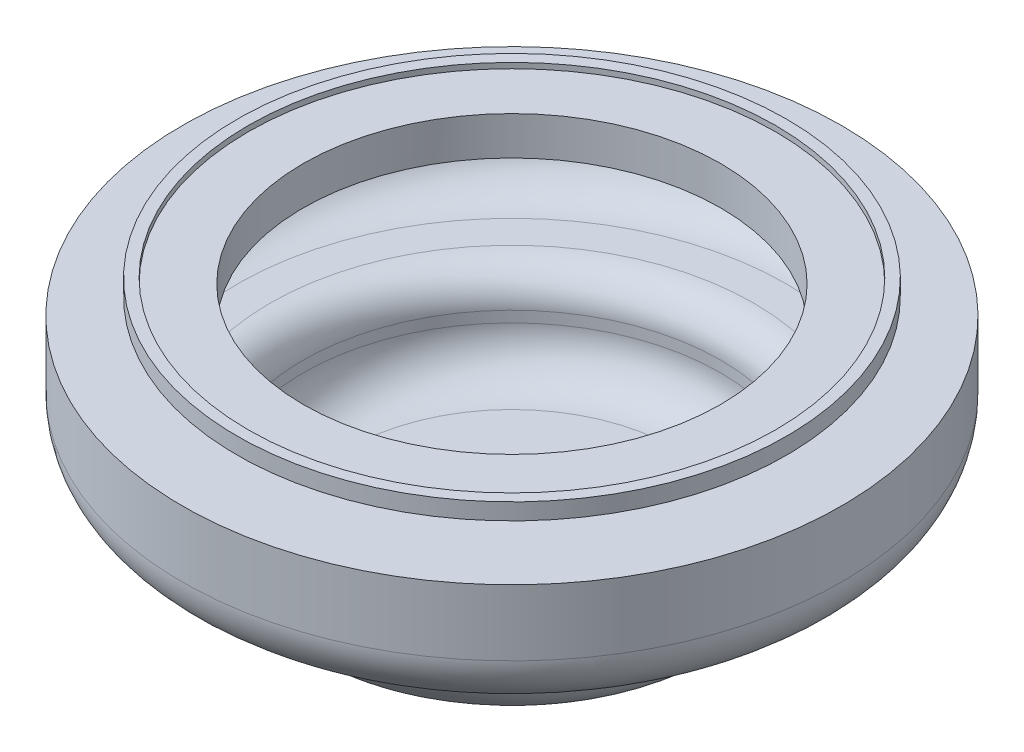
ISO-10303-21;
HEADER;
FILE_DESCRIPTION(('STEP AP214'),'2;1');
FILE_NAME('part.step','',(''),(''),'','','');
FILE_SCHEMA(('AUTOMOTIVE_DESIGN { 1 0 10303 214 1 1 1 1 }'));
ENDSEC;
DATA;
#1=APPLICATION_CONTEXT('core data for automotive mechanical design processes');
#2=APPLICATION_PROTOCOL_DEFINITION('international standard','automotive_design',2000,#1);
#3=PRODUCT_CONTEXT('',#1,'mechanical');
#4=PRODUCT('Part','Part','',(#3));
#5=PRODUCT_RELATED_PRODUCT_CATEGORY('part','',(#4));
#6=PRODUCT_DEFINITION_FORMATION('','',#4);
#7=PRODUCT_DEFINITION_CONTEXT('part definition',#1,'design');
#8=PRODUCT_DEFINITION('design','',#6,#7);
#9=PRODUCT_DEFINITION_SHAPE('','',#8);
#10=(LENGTH_UNIT() NAMED_UNIT(*) SI_UNIT(.MILLI.,.METRE.));
#11=(NAMED_UNIT(*) PLANE_ANGLE_UNIT() SI_UNIT($,.RADIAN.));
#12=(NAMED_UNIT(*) SI_UNIT($,.STERADIAN.) SOLID_ANGLE_UNIT());
#13=UNCERTAINTY_MEASURE_WITH_UNIT(LENGTH_MEASURE(1.E-05),#10,'distance_accuracy_value','');
#14=(GEOMETRIC_REPRESENTATION_CONTEXT(3) GLOBAL_UNCERTAINTY_ASSIGNED_CONTEXT((#13)) GLOBAL_UNIT_ASSIGNED_CONTEXT((#10,
#11,#12)) REPRESENTATION_CONTEXT('',''));
#15=CARTESIAN_POINT('',(0.,0.,0.));
#16=DIRECTION('',(0.,0.,1.));
#17=DIRECTION('',(1.,0.,0.));
#18=AXIS2_PLACEMENT_3D('',#15,#16,#17);
#19=CARTESIAN_POINT('',(0.,0.,0.));
#20=DIRECTION('',(0.,-1.,0.));
#21=DIRECTION('',(0.,0.,-1.));
#22=AXIS2_PLACEMENT_3D('',#19,#20,#21);
#23=PLANE('',#22);
#24=CARTESIAN_POINT('',(0.,0.,0.));
#25=DIRECTION('',(0.,-1.,0.));
#26=DIRECTION('',(0.,0.,-1.));
#27=AXIS2_PLACEMENT_3D('',#24,#25,#26);
#28=CIRCLE('',#27,24.);
#29=CARTESIAN_POINT('',(0.,0.,-24.));
#30=VERTEX_POINT('',#29);
#31=EDGE_CURVE('E75',#30,#30,#28,.T.);
#32=ORIENTED_EDGE('',*,*,#31,.T.);
#33=EDGE_LOOP('',(#32));
#34=FACE_BOUND('',#33,.T.);
#35=CARTESIAN_POINT('',(0.,0.,0.));
#36=DIRECTION('',(0.,-1.,0.));
#37=DIRECTION('',(0.,0.,-1.));
#38=AXIS2_PLACEMENT_3D('',#35,#36,#37);
#39=CIRCLE('',#38,25.);
#40=CARTESIAN_POINT('',(0.,0.,-25.));
#41=VERTEX_POINT('',#40);
#42=EDGE_CURVE('E10',#41,#41,#39,.T.);
#43=ORIENTED_EDGE('',*,*,#42,.F.);
#44=EDGE_LOOP('',(#43));
#45=FACE_BOUND('',#44,.T.);
#46=ADVANCED_FACE('F35',(#34,#45),#23,.F.);
#47=CARTESIAN_POINT('',(0.,-22.,0.));
#48=DIRECTION('',(0.,-1.,0.));
#49=DIRECTION('',(0.,0.,-1.));
#50=AXIS2_PLACEMENT_3D('',#47,#48,#49);
#51=CYLINDRICAL_SURFACE('',#50,25.);
#52=CARTESIAN_POINT('',(0.,-1.5,0.));
#53=DIRECTION('',(0.,-1.,0.));
#54=DIRECTION('',(0.,0.,-1.));
#55=AXIS2_PLACEMENT_3D('',#52,#53,#54);
#56=CIRCLE('',#55,25.);
#57=CARTESIAN_POINT('',(0.,-1.5,-25.));
#58=VERTEX_POINT('',#57);
#59=EDGE_CURVE('E41',#58,#58,#56,.T.);
#60=ORIENTED_EDGE('',*,*,#59,.F.);
#61=EDGE_LOOP('',(#60));
#62=FACE_BOUND('',#61,.T.);
#63=ORIENTED_EDGE('',*,*,#42,.T.);
#64=EDGE_LOOP('',(#63));
#65=FACE_BOUND('',#64,.T.);
#66=ADVANCED_FACE('F127',(#62,#65),#51,.T.);
#67=CARTESIAN_POINT('',(-25.,-1.5,0.));
#68=DIRECTION('',(0.,1.,0.));
#69=DIRECTION('',(0.,0.,1.));
#70=AXIS2_PLACEMENT_3D('',#67,#68,#69);
#71=PLANE('',#70);
#72=CARTESIAN_POINT('',(0.,-1.5,0.));
#73=DIRECTION('',(0.,-1.,0.));
#74=DIRECTION('',(0.,0.,-1.));
#75=AXIS2_PLACEMENT_3D('',#72,#73,#74);
#76=CIRCLE('',#75,20.);
#77=CARTESIAN_POINT('',(0.,-1.5,-20.));
#78=VERTEX_POINT('',#77);
#79=EDGE_CURVE('E45',#78,#78,#76,.T.);
#80=ORIENTED_EDGE('',*,*,#79,.F.);
#81=EDGE_LOOP('',(#80));
#82=FACE_BOUND('',#81,.T.);
#83=ORIENTED_EDGE('',*,*,#59,.T.);
#84=EDGE_LOOP('',(#83));
#85=FACE_BOUND('',#84,.T.);
#86=ADVANCED_FACE('F132',(#82,#85),#71,.F.);
#87=CARTESIAN_POINT('',(0.,-22.,0.));
#88=DIRECTION('',(0.,-1.,0.));
#89=DIRECTION('',(0.,0.,-1.));
#90=AXIS2_PLACEMENT_3D('',#87,#88,#89);
#91=CYLINDRICAL_SURFACE('',#90,20.);
#92=CARTESIAN_POINT('',(0.,-3.,0.));
#93=DIRECTION('',(0.,-1.,0.));
#94=DIRECTION('',(0.,0.,-1.));
#95=AXIS2_PLACEMENT_3D('',#92,#93,#94);
#96=CIRCLE('',#95,20.);
#97=CARTESIAN_POINT('',(0.,-3.,-20.));
#98=VERTEX_POINT('',#97);
#99=EDGE_CURVE('E49',#98,#98,#96,.T.);
#100=ORIENTED_EDGE('',*,*,#99,.F.);
#101=EDGE_LOOP('',(#100));
#102=FACE_BOUND('',#101,.T.);
#103=ORIENTED_EDGE('',*,*,#79,.T.);
#104=EDGE_LOOP('',(#103));
#105=FACE_BOUND('',#104,.T.);
#106=ADVANCED_FACE('F139',(#102,#105),#91,.T.);
#107=CARTESIAN_POINT('',(-20.,-3.,0.));
#108=DIRECTION('',(0.,-1.,0.));
#109=DIRECTION('',(0.,0.,-1.));
#110=AXIS2_PLACEMENT_3D('',#107,#108,#109);
#111=PLANE('',#110);
#112=CARTESIAN_POINT('',(0.,-3.00000000000001,0.));
#113=DIRECTION('',(0.,-1.,0.));
#114=DIRECTION('',(0.,0.,-1.));
#115=AXIS2_PLACEMENT_3D('',#112,#113,#114);
#116=CIRCLE('',#115,30.);
#117=CARTESIAN_POINT('',(0.,-3.00000000000001,-30.));
#118=VERTEX_POINT('',#117);
#119=EDGE_CURVE('E54',#118,#118,#116,.T.);
#120=ORIENTED_EDGE('',*,*,#119,.F.);
#121=EDGE_LOOP('',(#120));
#122=FACE_BOUND('',#121,.T.);
#123=ORIENTED_EDGE('',*,*,#99,.T.);
#124=EDGE_LOOP('',(#123));
#125=FACE_BOUND('',#124,.T.);
#126=ADVANCED_FACE('F145',(#122,#125),#111,.F.);
#127=CARTESIAN_POINT('',(0.,-22.,0.));
#128=DIRECTION('',(0.,-1.,0.));
#129=DIRECTION('',(0.,0.,-1.));
#130=AXIS2_PLACEMENT_3D('',#127,#128,#129);
#131=CYLINDRICAL_SURFACE('',#130,30.);
#132=CARTESIAN_POINT('',(0.,-9.00000000000001,0.));
#133=DIRECTION('',(0.,-1.,0.));
#134=DIRECTION('',(0.,0.,-1.));
#135=AXIS2_PLACEMENT_3D('',#132,#133,#134);
#136=CIRCLE('',#135,30.);
#137=CARTESIAN_POINT('',(0.,-9.00000000000001,-30.));
#138=VERTEX_POINT('',#137);
#139=EDGE_CURVE('E57',#138,#138,#136,.T.);
#140=ORIENTED_EDGE('',*,*,#139,.F.);
#141=EDGE_LOOP('',(#140));
#142=FACE_BOUND('',#141,.T.);
#143=ORIENTED_EDGE('',*,*,#119,.T.);
#144=EDGE_LOOP('',(#143));
#145=FACE_BOUND('',#144,.T.);
#146=ADVANCED_FACE('F149',(#142,#145),#131,.T.);
#147=CARTESIAN_POINT('',(0.,-9.00000000000001,0.));
#148=DIRECTION('',(0.,-1.,0.));
#149=DIRECTION('',(0.,0.,-1.));
#150=AXIS2_PLACEMENT_3D('',#147,#148,#149);
#151=TOROIDAL_SURFACE('',#150,25.,5.);
#152=CARTESIAN_POINT('',(0.,-14.,0.));
#153=DIRECTION('',(0.,-1.,0.));
#154=DIRECTION('',(0.,0.,-1.));
#155=AXIS2_PLACEMENT_3D('',#152,#153,#154);
#156=CIRCLE('',#155,25.);
#157=CARTESIAN_POINT('',(0.,-14.,-25.));
#158=VERTEX_POINT('',#157);
#159=EDGE_CURVE('E60',#158,#158,#156,.T.);
#160=ORIENTED_EDGE('',*,*,#159,.F.);
#161=EDGE_LOOP('',(#160));
#162=FACE_BOUND('',#161,.T.);
#163=ORIENTED_EDGE('',*,*,#139,.T.);
#164=EDGE_LOOP('',(#163));
#165=FACE_BOUND('',#164,.T.);
#166=ADVANCED_FACE('F153',(#162,#165),#151,.T.);
#167=CARTESIAN_POINT('',(-25.,-14.,0.));
#168=DIRECTION('',(0.,1.,0.));
#169=DIRECTION('',(0.,0.,1.));
#170=AXIS2_PLACEMENT_3D('',#167,#168,#169);
#171=PLANE('',#170);
#172=CARTESIAN_POINT('',(0.,-14.,0.));
#173=DIRECTION('',(0.,-1.,0.));
#174=DIRECTION('',(0.,0.,-1.));
#175=AXIS2_PLACEMENT_3D('',#172,#173,#174);
#176=CIRCLE('',#175,22.);
#177=CARTESIAN_POINT('',(0.,-14.,-22.));
#178=VERTEX_POINT('',#177);
#179=EDGE_CURVE('E63',#178,#178,#176,.T.);
#180=ORIENTED_EDGE('',*,*,#179,.F.);
#181=EDGE_LOOP('',(#180));
#182=FACE_BOUND('',#181,.T.);
#183=ORIENTED_EDGE('',*,*,#159,.T.);
#184=EDGE_LOOP('',(#183));
#185=FACE_BOUND('',#184,.T.);
#186=ADVANCED_FACE('F157',(#182,#185),#171,.F.);
#187=CARTESIAN_POINT('',(0.,-16.,0.));
#188=DIRECTION('',(0.,-1.,0.));
#189=DIRECTION('',(0.,0.,-1.));
#190=AXIS2_PLACEMENT_3D('',#187,#188,#189);
#191=TOROIDAL_SURFACE('',#190,22.,2.);
#192=CARTESIAN_POINT('',(0.,-16.,0.));
#193=DIRECTION('',(0.,-1.,0.));
#194=DIRECTION('',(0.,0.,-1.));
#195=AXIS2_PLACEMENT_3D('',#192,#193,#194);
#196=CIRCLE('',#195,20.);
#197=CARTESIAN_POINT('',(0.,-16.,-20.));
#198=VERTEX_POINT('',#197);
#199=EDGE_CURVE('E66',#198,#198,#196,.T.);
#200=ORIENTED_EDGE('',*,*,#199,.F.);
#201=EDGE_LOOP('',(#200));
#202=FACE_BOUND('',#201,.T.);
#203=ORIENTED_EDGE('',*,*,#179,.T.);
#204=EDGE_LOOP('',(#203));
#205=FACE_BOUND('',#204,.T.);
#206=ADVANCED_FACE('F161',(#202,#205),#191,.F.);
#207=CARTESIAN_POINT('',(0.,-22.,0.));
#208=DIRECTION('',(0.,-1.,0.));
#209=DIRECTION('',(0.,0.,-1.));
#210=AXIS2_PLACEMENT_3D('',#207,#208,#209);
#211=CYLINDRICAL_SURFACE('',#210,20.);
#212=CARTESIAN_POINT('',(0.,-17.,0.));
#213=DIRECTION('',(0.,-1.,0.));
#214=DIRECTION('',(0.,0.,-1.));
#215=AXIS2_PLACEMENT_3D('',#212,#213,#214);
#216=CIRCLE('',#215,20.);
#217=CARTESIAN_POINT('',(0.,-17.,-20.));
#218=VERTEX_POINT('',#217);
#219=EDGE_CURVE('E69',#218,#218,#216,.T.);
#220=ORIENTED_EDGE('',*,*,#219,.F.);
#221=EDGE_LOOP('',(#220));
#222=FACE_BOUND('',#221,.T.);
#223=ORIENTED_EDGE('',*,*,#199,.T.);
#224=EDGE_LOOP('',(#223));
#225=FACE_BOUND('',#224,.T.);
#226=ADVANCED_FACE('F165',(#222,#225),#211,.T.);
#227=CARTESIAN_POINT('',(0.,-17.,0.));
#228=DIRECTION('',(0.,-1.,0.));
#229=DIRECTION('',(0.,0.,-1.));
#230=AXIS2_PLACEMENT_3D('',#227,#228,#229);
#231=TOROIDAL_SURFACE('',#230,15.,5.);
#232=CARTESIAN_POINT('',(0.,-22.,0.));
#233=DIRECTION('',(0.,-1.,0.));
#234=DIRECTION('',(0.,0.,-1.));
#235=AXIS2_PLACEMENT_3D('',#232,#233,#234);
#236=CIRCLE('',#235,15.);
#237=CARTESIAN_POINT('',(0.,-22.,-15.));
#238=VERTEX_POINT('',#237);
#239=EDGE_CURVE('E72',#238,#238,#236,.T.);
#240=ORIENTED_EDGE('',*,*,#239,.F.);
#241=EDGE_LOOP('',(#240));
#242=FACE_BOUND('',#241,.T.);
#243=ORIENTED_EDGE('',*,*,#219,.T.);
#244=EDGE_LOOP('',(#243));
#245=FACE_BOUND('',#244,.T.);
#246=ADVANCED_FACE('F169',(#242,#245),#231,.T.);
#247=CARTESIAN_POINT('',(-15.,-22.,0.));
#248=DIRECTION('',(0.,1.,0.));
#249=DIRECTION('',(0.,0.,1.));
#250=AXIS2_PLACEMENT_3D('',#247,#248,#249);
#251=PLANE('',#250);
#252=ORIENTED_EDGE('',*,*,#239,.T.);
#253=EDGE_LOOP('',(#252));
#254=FACE_BOUND('',#253,.T.);
#255=ADVANCED_FACE('F124',(#254),#251,.F.);
#256=CARTESIAN_POINT('',(0.,-22.,0.));
#257=DIRECTION('',(0.,-1.,0.));
#258=DIRECTION('',(0.,0.,-1.));
#259=AXIS2_PLACEMENT_3D('',#256,#257,#258);
#260=CYLINDRICAL_SURFACE('',#259,24.);
#261=CARTESIAN_POINT('',(0.,-0.500000000000004,0.));
#262=DIRECTION('',(0.,1.,0.));
#263=DIRECTION('',(0.,0.,1.));
#264=AXIS2_PLACEMENT_3D('',#261,#262,#263);
#265=CIRCLE('',#264,24.);
#266=CARTESIAN_POINT('',(0.,-0.500000000000004,24.));
#267=VERTEX_POINT('',#266);
#268=EDGE_CURVE('E78',#267,#267,#265,.F.);
#269=ORIENTED_EDGE('',*,*,#268,.T.);
#270=EDGE_LOOP('',(#269));
#271=FACE_BOUND('',#270,.T.);
#272=ORIENTED_EDGE('',*,*,#31,.F.);
#273=EDGE_LOOP('',(#272));
#274=FACE_BOUND('',#273,.T.);
#275=ADVANCED_FACE('F109',(#271,#274),#260,.F.);
#276=CARTESIAN_POINT('',(-25.,-0.500000000000003,0.));
#277=DIRECTION('',(0.,1.,0.));
#278=DIRECTION('',(0.,0.,1.));
#279=AXIS2_PLACEMENT_3D('',#276,#277,#278);
#280=PLANE('',#279);
#281=CARTESIAN_POINT('',(0.,-0.500000000000004,0.));
#282=DIRECTION('',(0.,1.,0.));
#283=DIRECTION('',(0.,0.,1.));
#284=AXIS2_PLACEMENT_3D('',#281,#282,#283);
#285=CIRCLE('',#284,19.);
#286=CARTESIAN_POINT('',(0.,-0.500000000000004,19.));
#287=VERTEX_POINT('',#286);
#288=EDGE_CURVE('E103',#287,#287,#285,.F.);
#289=ORIENTED_EDGE('',*,*,#288,.T.);
#290=EDGE_LOOP('',(#289));
#291=FACE_BOUND('',#290,.T.);
#292=ORIENTED_EDGE('',*,*,#268,.F.);
#293=EDGE_LOOP('',(#292));
#294=FACE_BOUND('',#293,.T.);
#295=ADVANCED_FACE('F112',(#291,#294),#280,.T.);
#296=CARTESIAN_POINT('',(0.,-22.,0.));
#297=DIRECTION('',(0.,-1.,0.));
#298=DIRECTION('',(0.,0.,-1.));
#299=AXIS2_PLACEMENT_3D('',#296,#297,#298);
#300=CYLINDRICAL_SURFACE('',#299,19.);
#301=CARTESIAN_POINT('',(0.,-4.,0.));
#302=DIRECTION('',(0.,-1.,0.));
#303=DIRECTION('',(0.,0.,-1.));
#304=AXIS2_PLACEMENT_3D('',#301,#302,#303);
#305=CIRCLE('',#304,19.);
#306=CARTESIAN_POINT('',(0.,-4.,-19.));
#307=VERTEX_POINT('',#306);
#308=EDGE_CURVE('E100',#307,#307,#305,.T.);
#309=ORIENTED_EDGE('',*,*,#308,.T.);
#310=EDGE_LOOP('',(#309));
#311=FACE_BOUND('',#310,.T.);
#312=ORIENTED_EDGE('',*,*,#288,.F.);
#313=EDGE_LOOP('',(#312));
#314=FACE_BOUND('',#313,.T.);
#315=ADVANCED_FACE('F114',(#311,#314),#300,.F.);
#316=CARTESIAN_POINT('',(-20.,-4.,0.));
#317=DIRECTION('',(0.,-1.,0.));
#318=DIRECTION('',(0.,0.,-1.));
#319=AXIS2_PLACEMENT_3D('',#316,#317,#318);
#320=PLANE('',#319);
#321=CARTESIAN_POINT('',(0.,-4.,0.));
#322=DIRECTION('',(0.,-1.,0.));
#323=DIRECTION('',(0.,0.,-1.));
#324=AXIS2_PLACEMENT_3D('',#321,#322,#323);
#325=CIRCLE('',#324,29.);
#326=CARTESIAN_POINT('',(0.,-4.,-29.));
#327=VERTEX_POINT('',#326);
#328=EDGE_CURVE('E97',#327,#327,#325,.T.);
#329=ORIENTED_EDGE('',*,*,#328,.T.);
#330=EDGE_LOOP('',(#329));
#331=FACE_BOUND('',#330,.T.);
#332=ORIENTED_EDGE('',*,*,#308,.F.);
#333=EDGE_LOOP('',(#332));
#334=FACE_BOUND('',#333,.T.);
#335=ADVANCED_FACE('F121',(#331,#334),#320,.T.);
#336=CARTESIAN_POINT('',(0.,-22.,0.));
#337=DIRECTION('',(0.,-1.,0.));
#338=DIRECTION('',(0.,0.,-1.));
#339=AXIS2_PLACEMENT_3D('',#336,#337,#338);
#340=CYLINDRICAL_SURFACE('',#339,29.);
#341=CARTESIAN_POINT('',(0.,-9.00000000000001,0.));
#342=DIRECTION('',(0.,-1.,0.));
#343=DIRECTION('',(0.,0.,-1.));
#344=AXIS2_PLACEMENT_3D('',#341,#342,#343);
#345=CIRCLE('',#344,29.);
#346=CARTESIAN_POINT('',(0.,-9.00000000000001,-29.));
#347=VERTEX_POINT('',#346);
#348=EDGE_CURVE('E94',#347,#347,#345,.T.);
#349=ORIENTED_EDGE('',*,*,#348,.T.);
#350=EDGE_LOOP('',(#349));
#351=FACE_BOUND('',#350,.T.);
#352=ORIENTED_EDGE('',*,*,#328,.F.);
#353=EDGE_LOOP('',(#352));
#354=FACE_BOUND('',#353,.T.);
#355=ADVANCED_FACE('F200',(#351,#354),#340,.F.);
#356=CARTESIAN_POINT('',(0.,-9.00000000000001,0.));
#357=DIRECTION('',(0.,-1.,0.));
#358=DIRECTION('',(0.,0.,-1.));
#359=AXIS2_PLACEMENT_3D('',#356,#357,#358);
#360=TOROIDAL_SURFACE('',#359,25.,4.);
#361=CARTESIAN_POINT('',(0.,-13.,0.));
#362=DIRECTION('',(0.,-1.,0.));
#363=DIRECTION('',(0.,0.,-1.));
#364=AXIS2_PLACEMENT_3D('',#361,#362,#363);
#365=CIRCLE('',#364,25.);
#366=CARTESIAN_POINT('',(0.,-13.,-25.));
#367=VERTEX_POINT('',#366);
#368=EDGE_CURVE('E91',#367,#367,#365,.T.);
#369=ORIENTED_EDGE('',*,*,#368,.T.);
#370=EDGE_LOOP('',(#369));
#371=FACE_BOUND('',#370,.T.);
#372=ORIENTED_EDGE('',*,*,#348,.F.);
#373=EDGE_LOOP('',(#372));
#374=FACE_BOUND('',#373,.T.);
#375=ADVANCED_FACE('F196',(#371,#374),#360,.F.);
#376=CARTESIAN_POINT('',(-25.,-13.,0.));
#377=DIRECTION('',(0.,1.,0.));
#378=DIRECTION('',(0.,0.,1.));
#379=AXIS2_PLACEMENT_3D('',#376,#377,#378);
#380=PLANE('',#379);
#381=CARTESIAN_POINT('',(0.,-13.,0.));
#382=DIRECTION('',(0.,-1.,0.));
#383=DIRECTION('',(0.,0.,-1.));
#384=AXIS2_PLACEMENT_3D('',#381,#382,#383);
#385=CIRCLE('',#384,22.);
#386=CARTESIAN_POINT('',(0.,-13.,-22.));
#387=VERTEX_POINT('',#386);
#388=EDGE_CURVE('E88',#387,#387,#385,.T.);
#389=ORIENTED_EDGE('',*,*,#388,.T.);
#390=EDGE_LOOP('',(#389));
#391=FACE_BOUND('',#390,.T.);
#392=ORIENTED_EDGE('',*,*,#368,.F.);
#393=EDGE_LOOP('',(#392));
#394=FACE_BOUND('',#393,.T.);
#395=ADVANCED_FACE('F192',(#391,#394),#380,.T.);
#396=CARTESIAN_POINT('',(0.,-16.,0.));
#397=DIRECTION('',(0.,-1.,0.));
#398=DIRECTION('',(0.,0.,-1.));
#399=AXIS2_PLACEMENT_3D('',#396,#397,#398);
#400=TOROIDAL_SURFACE('',#399,22.,3.);
#401=CARTESIAN_POINT('',(0.,-16.,0.));
#402=DIRECTION('',(0.,-1.,0.));
#403=DIRECTION('',(0.,0.,-1.));
#404=AXIS2_PLACEMENT_3D('',#401,#402,#403);
#405=CIRCLE('',#404,19.);
#406=CARTESIAN_POINT('',(0.,-16.,-19.));
#407=VERTEX_POINT('',#406);
#408=EDGE_CURVE('E85',#407,#407,#405,.T.);
#409=ORIENTED_EDGE('',*,*,#408,.T.);
#410=EDGE_LOOP('',(#409));
#411=FACE_BOUND('',#410,.T.);
#412=ORIENTED_EDGE('',*,*,#388,.F.);
#413=EDGE_LOOP('',(#412));
#414=FACE_BOUND('',#413,.T.);
#415=ADVANCED_FACE('F188',(#411,#414),#400,.T.);
#416=CARTESIAN_POINT('',(0.,-22.,0.));
#417=DIRECTION('',(0.,-1.,0.));
#418=DIRECTION('',(0.,0.,-1.));
#419=AXIS2_PLACEMENT_3D('',#416,#417,#418);
#420=CYLINDRICAL_SURFACE('',#419,19.);
#421=CARTESIAN_POINT('',(0.,-17.,0.));
#422=DIRECTION('',(0.,-1.,0.));
#423=DIRECTION('',(0.,0.,-1.));
#424=AXIS2_PLACEMENT_3D('',#421,#422,#423);
#425=CIRCLE('',#424,19.);
#426=CARTESIAN_POINT('',(0.,-17.,-19.));
#427=VERTEX_POINT('',#426);
#428=EDGE_CURVE('E82',#427,#427,#425,.T.);
#429=ORIENTED_EDGE('',*,*,#428,.T.);
#430=EDGE_LOOP('',(#429));
#431=FACE_BOUND('',#430,.T.);
#432=ORIENTED_EDGE('',*,*,#408,.F.);
#433=EDGE_LOOP('',(#432));
#434=FACE_BOUND('',#433,.T.);
#435=ADVANCED_FACE('F184',(#431,#434),#420,.F.);
#436=CARTESIAN_POINT('',(0.,-17.,0.));
#437=DIRECTION('',(0.,-1.,0.));
#438=DIRECTION('',(0.,0.,-1.));
#439=AXIS2_PLACEMENT_3D('',#436,#437,#438);
#440=TOROIDAL_SURFACE('',#439,15.,4.);
#441=CARTESIAN_POINT('',(0.,-21.,0.));
#442=DIRECTION('',(0.,-1.,0.));
#443=DIRECTION('',(0.,0.,-1.));
#444=AXIS2_PLACEMENT_3D('',#441,#442,#443);
#445=CIRCLE('',#444,15.);
#446=CARTESIAN_POINT('',(0.,-21.,-15.));
#447=VERTEX_POINT('',#446);
#448=EDGE_CURVE('E79',#447,#447,#445,.T.);
#449=ORIENTED_EDGE('',*,*,#448,.T.);
#450=EDGE_LOOP('',(#449));
#451=FACE_BOUND('',#450,.T.);
#452=ORIENTED_EDGE('',*,*,#428,.F.);
#453=EDGE_LOOP('',(#452));
#454=FACE_BOUND('',#453,.T.);
#455=ADVANCED_FACE('F180',(#451,#454),#440,.F.);
#456=CARTESIAN_POINT('',(-15.,-21.,0.));
#457=DIRECTION('',(0.,1.,0.));
#458=DIRECTION('',(0.,0.,1.));
#459=AXIS2_PLACEMENT_3D('',#456,#457,#458);
#460=PLANE('',#459);
#461=ORIENTED_EDGE('',*,*,#448,.F.);
#462=EDGE_LOOP('',(#461));
#463=FACE_BOUND('',#462,.T.);
#464=ADVANCED_FACE('F177',(#463),#460,.T.);
#465=CLOSED_SHELL('',(#46,#66,#86,#106,#126,#146,#166,#186,#206,#226,#246,#255,#275,#295,#315,
#335,#355,#375,#395,#415,#435,#455,#464));
#466=MANIFOLD_SOLID_BREP('B2',#465);
#467=ADVANCED_BREP_SHAPE_REPRESENTATION('',(#18,#466),#14);
#468=SHAPE_DEFINITION_REPRESENTATION(#9,#467);
ENDSEC;
END-ISO-10303-21;
